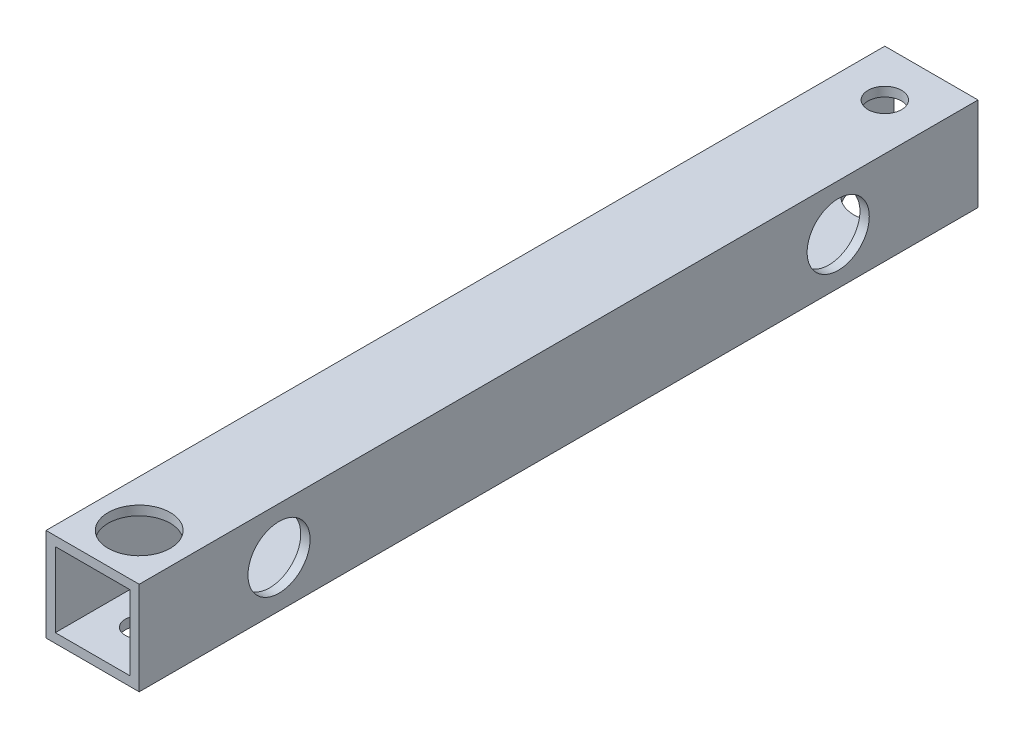
ISO-10303-21;
HEADER;
FILE_DESCRIPTION(('STEP AP214'),'2;1');
FILE_NAME('part.step','',(''),(''),'','','');
FILE_SCHEMA(('AUTOMOTIVE_DESIGN { 1 0 10303 214 1 1 1 1 }'));
ENDSEC;
DATA;
#1=APPLICATION_CONTEXT('core data for automotive mechanical design processes');
#2=APPLICATION_PROTOCOL_DEFINITION('international standard','automotive_design',2000,#1);
#3=PRODUCT_CONTEXT('',#1,'mechanical');
#4=PRODUCT('Part','Part','',(#3));
#5=PRODUCT_RELATED_PRODUCT_CATEGORY('part','',(#4));
#6=PRODUCT_DEFINITION_FORMATION('','',#4);
#7=PRODUCT_DEFINITION_CONTEXT('part definition',#1,'design');
#8=PRODUCT_DEFINITION('design','',#6,#7);
#9=PRODUCT_DEFINITION_SHAPE('','',#8);
#10=(LENGTH_UNIT() NAMED_UNIT(*) SI_UNIT(.MILLI.,.METRE.));
#11=(NAMED_UNIT(*) PLANE_ANGLE_UNIT() SI_UNIT($,.RADIAN.));
#12=(NAMED_UNIT(*) SI_UNIT($,.STERADIAN.) SOLID_ANGLE_UNIT());
#13=UNCERTAINTY_MEASURE_WITH_UNIT(LENGTH_MEASURE(1.E-05),#10,'distance_accuracy_value','');
#14=(GEOMETRIC_REPRESENTATION_CONTEXT(3) GLOBAL_UNCERTAINTY_ASSIGNED_CONTEXT((#13)) GLOBAL_UNIT_ASSIGNED_CONTEXT((#10,
#11,#12)) REPRESENTATION_CONTEXT('',''));
#15=CARTESIAN_POINT('',(0.,0.,0.));
#16=DIRECTION('',(0.,0.,1.));
#17=DIRECTION('',(1.,0.,0.));
#18=AXIS2_PLACEMENT_3D('',#15,#16,#17);
#19=CARTESIAN_POINT('',(0.,0.,135.));
#20=DIRECTION('',(0.,0.,-1.));
#21=DIRECTION('',(-1.,0.,0.));
#22=AXIS2_PLACEMENT_3D('',#19,#20,#21);
#23=PLANE('',#22);
#24=DIRECTION('',(0.,1.,0.));
#25=VECTOR('',#24,1.);
#26=CARTESIAN_POINT('',(7.5,-7.5,135.));
#27=LINE('',#26,#25);
#28=CARTESIAN_POINT('',(7.5,-7.5,135.));
#29=VERTEX_POINT('',#28);
#30=CARTESIAN_POINT('',(7.5,7.5,135.));
#31=VERTEX_POINT('',#30);
#32=EDGE_CURVE('E162',#29,#31,#27,.T.);
#33=ORIENTED_EDGE('',*,*,#32,.T.);
#34=DIRECTION('',(-1.,0.,0.));
#35=VECTOR('',#34,1.);
#36=CARTESIAN_POINT('',(-7.5,7.5,135.));
#37=LINE('',#36,#35);
#38=CARTESIAN_POINT('',(-7.5,7.5,135.));
#39=VERTEX_POINT('',#38);
#40=EDGE_CURVE('E166',#31,#39,#37,.T.);
#41=ORIENTED_EDGE('',*,*,#40,.T.);
#42=DIRECTION('',(0.,-1.,0.));
#43=VECTOR('',#42,1.);
#44=CARTESIAN_POINT('',(-7.5,-7.5,135.));
#45=LINE('',#44,#43);
#46=CARTESIAN_POINT('',(-7.5,-7.5,135.));
#47=VERTEX_POINT('',#46);
#48=EDGE_CURVE('E170',#39,#47,#45,.T.);
#49=ORIENTED_EDGE('',*,*,#48,.T.);
#50=DIRECTION('',(1.,0.,0.));
#51=VECTOR('',#50,1.);
#52=CARTESIAN_POINT('',(-7.5,-7.5,135.));
#53=LINE('',#52,#51);
#54=EDGE_CURVE('E173',#47,#29,#53,.T.);
#55=ORIENTED_EDGE('',*,*,#54,.T.);
#56=EDGE_LOOP('',(#33,#41,#49,#55));
#57=FACE_BOUND('',#56,.T.);
#58=DIRECTION('',(0.,1.,0.));
#59=VECTOR('',#58,1.);
#60=CARTESIAN_POINT('',(6.,-6.,135.));
#61=LINE('',#60,#59);
#62=CARTESIAN_POINT('',(6.,-6.,135.));
#63=VERTEX_POINT('',#62);
#64=CARTESIAN_POINT('',(6.,6.,135.));
#65=VERTEX_POINT('',#64);
#66=EDGE_CURVE('E111',#63,#65,#61,.T.);
#67=ORIENTED_EDGE('',*,*,#66,.F.);
#68=DIRECTION('',(1.,0.,0.));
#69=VECTOR('',#68,1.);
#70=CARTESIAN_POINT('',(-6.,-6.,135.));
#71=LINE('',#70,#69);
#72=CARTESIAN_POINT('',(-6.,-6.,135.));
#73=VERTEX_POINT('',#72);
#74=EDGE_CURVE('E138',#73,#63,#71,.T.);
#75=ORIENTED_EDGE('',*,*,#74,.F.);
#76=DIRECTION('',(0.,-1.,0.));
#77=VECTOR('',#76,1.);
#78=CARTESIAN_POINT('',(-6.,-6.,135.));
#79=LINE('',#78,#77);
#80=CARTESIAN_POINT('',(-6.,6.,135.));
#81=VERTEX_POINT('',#80);
#82=EDGE_CURVE('E133',#81,#73,#79,.T.);
#83=ORIENTED_EDGE('',*,*,#82,.F.);
#84=DIRECTION('',(-1.,0.,0.));
#85=VECTOR('',#84,1.);
#86=CARTESIAN_POINT('',(-6.,6.,135.));
#87=LINE('',#86,#85);
#88=EDGE_CURVE('E120',#65,#81,#87,.T.);
#89=ORIENTED_EDGE('',*,*,#88,.F.);
#90=EDGE_LOOP('',(#67,#75,#83,#89));
#91=FACE_BOUND('',#90,.T.);
#92=ADVANCED_FACE('F43',(#57,#91),#23,.F.);
#93=CARTESIAN_POINT('',(0.,0.,0.));
#94=DIRECTION('',(0.,0.,-1.));
#95=DIRECTION('',(-1.,0.,0.));
#96=AXIS2_PLACEMENT_3D('',#93,#94,#95);
#97=PLANE('',#96);
#98=DIRECTION('',(0.,1.,0.));
#99=VECTOR('',#98,1.);
#100=CARTESIAN_POINT('',(7.5,-7.5,0.));
#101=LINE('',#100,#99);
#102=CARTESIAN_POINT('',(7.5,-7.5,0.));
#103=VERTEX_POINT('',#102);
#104=CARTESIAN_POINT('',(7.5,7.5,0.));
#105=VERTEX_POINT('',#104);
#106=EDGE_CURVE('E129',#103,#105,#101,.T.);
#107=ORIENTED_EDGE('',*,*,#106,.F.);
#108=DIRECTION('',(1.,0.,0.));
#109=VECTOR('',#108,1.);
#110=CARTESIAN_POINT('',(-7.5,-7.5,0.));
#111=LINE('',#110,#109);
#112=CARTESIAN_POINT('',(-7.5,-7.5,0.));
#113=VERTEX_POINT('',#112);
#114=EDGE_CURVE('E167',#113,#103,#111,.T.);
#115=ORIENTED_EDGE('',*,*,#114,.F.);
#116=DIRECTION('',(0.,-1.,0.));
#117=VECTOR('',#116,1.);
#118=CARTESIAN_POINT('',(-7.5,-7.5,0.));
#119=LINE('',#118,#117);
#120=CARTESIAN_POINT('',(-7.5,7.5,0.));
#121=VERTEX_POINT('',#120);
#122=EDGE_CURVE('E183',#121,#113,#119,.T.);
#123=ORIENTED_EDGE('',*,*,#122,.F.);
#124=DIRECTION('',(-1.,0.,0.));
#125=VECTOR('',#124,1.);
#126=CARTESIAN_POINT('',(-7.5,7.5,0.));
#127=LINE('',#126,#125);
#128=EDGE_CURVE('E180',#105,#121,#127,.T.);
#129=ORIENTED_EDGE('',*,*,#128,.F.);
#130=EDGE_LOOP('',(#107,#115,#123,#129));
#131=FACE_BOUND('',#130,.T.);
#132=DIRECTION('',(1.,0.,0.));
#133=VECTOR('',#132,1.);
#134=CARTESIAN_POINT('',(-6.,-6.,0.));
#135=LINE('',#134,#133);
#136=CARTESIAN_POINT('',(-6.,-6.,0.));
#137=VERTEX_POINT('',#136);
#138=CARTESIAN_POINT('',(6.,-6.,0.));
#139=VERTEX_POINT('',#138);
#140=EDGE_CURVE('E121',#137,#139,#135,.T.);
#141=ORIENTED_EDGE('',*,*,#140,.T.);
#142=DIRECTION('',(0.,1.,0.));
#143=VECTOR('',#142,1.);
#144=CARTESIAN_POINT('',(6.,-6.,0.));
#145=LINE('',#144,#143);
#146=CARTESIAN_POINT('',(6.,6.,0.));
#147=VERTEX_POINT('',#146);
#148=EDGE_CURVE('E69',#139,#147,#145,.T.);
#149=ORIENTED_EDGE('',*,*,#148,.T.);
#150=DIRECTION('',(-1.,0.,0.));
#151=VECTOR('',#150,1.);
#152=CARTESIAN_POINT('',(-6.,6.,0.));
#153=LINE('',#152,#151);
#154=CARTESIAN_POINT('',(-6.,6.,0.));
#155=VERTEX_POINT('',#154);
#156=EDGE_CURVE('E127',#147,#155,#153,.T.);
#157=ORIENTED_EDGE('',*,*,#156,.T.);
#158=DIRECTION('',(0.,-1.,0.));
#159=VECTOR('',#158,1.);
#160=CARTESIAN_POINT('',(-6.,-6.,0.));
#161=LINE('',#160,#159);
#162=EDGE_CURVE('E149',#155,#137,#161,.T.);
#163=ORIENTED_EDGE('',*,*,#162,.T.);
#164=EDGE_LOOP('',(#141,#149,#157,#163));
#165=FACE_BOUND('',#164,.T.);
#166=ADVANCED_FACE('F275',(#131,#165),#97,.T.);
#167=CARTESIAN_POINT('',(7.5,-7.5,135.));
#168=DIRECTION('',(-1.,0.,0.));
#169=DIRECTION('',(0.,0.,1.));
#170=AXIS2_PLACEMENT_3D('',#167,#168,#169);
#171=PLANE('',#170);
#172=CARTESIAN_POINT('',(7.5,0.,22.5));
#173=DIRECTION('',(1.,0.,0.));
#174=DIRECTION('',(0.,0.,-1.));
#175=AXIS2_PLACEMENT_3D('',#172,#173,#174);
#176=CIRCLE('',#175,5.);
#177=CARTESIAN_POINT('',(7.5,0.,17.5));
#178=VERTEX_POINT('',#177);
#179=EDGE_CURVE('E223',#178,#178,#176,.T.);
#180=ORIENTED_EDGE('',*,*,#179,.F.);
#181=EDGE_LOOP('',(#180));
#182=FACE_BOUND('',#181,.T.);
#183=CARTESIAN_POINT('',(7.5,0.,112.5));
#184=DIRECTION('',(1.,0.,0.));
#185=DIRECTION('',(0.,0.,-1.));
#186=AXIS2_PLACEMENT_3D('',#183,#184,#185);
#187=CIRCLE('',#186,5.);
#188=CARTESIAN_POINT('',(7.5,0.,107.5));
#189=VERTEX_POINT('',#188);
#190=EDGE_CURVE('E237',#189,#189,#187,.T.);
#191=ORIENTED_EDGE('',*,*,#190,.F.);
#192=EDGE_LOOP('',(#191));
#193=FACE_BOUND('',#192,.T.);
#194=ORIENTED_EDGE('',*,*,#106,.T.);
#195=DIRECTION('',(0.,0.,-1.));
#196=VECTOR('',#195,1.);
#197=CARTESIAN_POINT('',(7.5,7.5,135.));
#198=LINE('',#197,#196);
#199=EDGE_CURVE('E11',#31,#105,#198,.T.);
#200=ORIENTED_EDGE('',*,*,#199,.F.);
#201=ORIENTED_EDGE('',*,*,#32,.F.);
#202=DIRECTION('',(0.,0.,-1.));
#203=VECTOR('',#202,1.);
#204=CARTESIAN_POINT('',(7.5,-7.5,135.));
#205=LINE('',#204,#203);
#206=EDGE_CURVE('E176',#29,#103,#205,.T.);
#207=ORIENTED_EDGE('',*,*,#206,.T.);
#208=EDGE_LOOP('',(#194,#200,#201,#207));
#209=FACE_BOUND('',#208,.T.);
#210=ADVANCED_FACE('F45',(#182,#193,#209),#171,.F.);
#211=CARTESIAN_POINT('',(-7.5,7.5,135.));
#212=DIRECTION('',(0.,-1.,0.));
#213=DIRECTION('',(0.,0.,-1.));
#214=AXIS2_PLACEMENT_3D('',#211,#212,#213);
#215=PLANE('',#214);
#216=CARTESIAN_POINT('',(0.,7.5,127.5));
#217=DIRECTION('',(0.,1.,0.));
#218=DIRECTION('',(0.,0.,1.));
#219=AXIS2_PLACEMENT_3D('',#216,#217,#218);
#220=CIRCLE('',#219,5.);
#221=CARTESIAN_POINT('',(0.,7.5,132.5));
#222=VERTEX_POINT('',#221);
#223=EDGE_CURVE('E218',#222,#222,#220,.T.);
#224=ORIENTED_EDGE('',*,*,#223,.F.);
#225=EDGE_LOOP('',(#224));
#226=FACE_BOUND('',#225,.T.);
#227=CARTESIAN_POINT('',(0.,7.5,7.50000000000001));
#228=DIRECTION('',(0.,1.,0.));
#229=DIRECTION('',(0.,0.,1.));
#230=AXIS2_PLACEMENT_3D('',#227,#228,#229);
#231=CIRCLE('',#230,2.7);
#232=CARTESIAN_POINT('',(0.,7.5,10.2));
#233=VERTEX_POINT('',#232);
#234=EDGE_CURVE('E213',#233,#233,#231,.T.);
#235=ORIENTED_EDGE('',*,*,#234,.F.);
#236=EDGE_LOOP('',(#235));
#237=FACE_BOUND('',#236,.T.);
#238=ORIENTED_EDGE('',*,*,#128,.T.);
#239=DIRECTION('',(0.,0.,-1.));
#240=VECTOR('',#239,1.);
#241=CARTESIAN_POINT('',(-7.5,7.5,135.));
#242=LINE('',#241,#240);
#243=EDGE_CURVE('E53',#39,#121,#242,.T.);
#244=ORIENTED_EDGE('',*,*,#243,.F.);
#245=ORIENTED_EDGE('',*,*,#40,.F.);
#246=ORIENTED_EDGE('',*,*,#199,.T.);
#247=EDGE_LOOP('',(#238,#244,#245,#246));
#248=FACE_BOUND('',#247,.T.);
#249=ADVANCED_FACE('F291',(#226,#237,#248),#215,.F.);
#250=CARTESIAN_POINT('',(-7.5,-7.5,135.));
#251=DIRECTION('',(1.,0.,0.));
#252=DIRECTION('',(0.,0.,-1.));
#253=AXIS2_PLACEMENT_3D('',#250,#251,#252);
#254=PLANE('',#253);
#255=CARTESIAN_POINT('',(-7.5,0.,112.5));
#256=DIRECTION('',(1.,0.,0.));
#257=DIRECTION('',(0.,0.,-1.));
#258=AXIS2_PLACEMENT_3D('',#255,#256,#257);
#259=CIRCLE('',#258,2.7);
#260=CARTESIAN_POINT('',(-7.5,0.,109.8));
#261=VERTEX_POINT('',#260);
#262=EDGE_CURVE('E146',#261,#261,#259,.T.);
#263=ORIENTED_EDGE('',*,*,#262,.T.);
#264=EDGE_LOOP('',(#263));
#265=FACE_BOUND('',#264,.T.);
#266=CARTESIAN_POINT('',(-7.5,0.,22.5));
#267=DIRECTION('',(1.,0.,0.));
#268=DIRECTION('',(0.,0.,-1.));
#269=AXIS2_PLACEMENT_3D('',#266,#267,#268);
#270=CIRCLE('',#269,2.7);
#271=CARTESIAN_POINT('',(-7.5,0.,19.8));
#272=VERTEX_POINT('',#271);
#273=EDGE_CURVE('E202',#272,#272,#270,.T.);
#274=ORIENTED_EDGE('',*,*,#273,.T.);
#275=EDGE_LOOP('',(#274));
#276=FACE_BOUND('',#275,.T.);
#277=ORIENTED_EDGE('',*,*,#122,.T.);
#278=DIRECTION('',(0.,0.,-1.));
#279=VECTOR('',#278,1.);
#280=CARTESIAN_POINT('',(-7.5,-7.5,135.));
#281=LINE('',#280,#279);
#282=EDGE_CURVE('E191',#47,#113,#281,.T.);
#283=ORIENTED_EDGE('',*,*,#282,.F.);
#284=ORIENTED_EDGE('',*,*,#48,.F.);
#285=ORIENTED_EDGE('',*,*,#243,.T.);
#286=EDGE_LOOP('',(#277,#283,#284,#285));
#287=FACE_BOUND('',#286,.T.);
#288=ADVANCED_FACE('F255',(#265,#276,#287),#254,.F.);
#289=CARTESIAN_POINT('',(-7.5,-7.5,135.));
#290=DIRECTION('',(0.,1.,0.));
#291=DIRECTION('',(0.,0.,1.));
#292=AXIS2_PLACEMENT_3D('',#289,#290,#291);
#293=PLANE('',#292);
#294=CARTESIAN_POINT('',(0.,-7.5,7.50000000000001));
#295=DIRECTION('',(0.,-1.,0.));
#296=DIRECTION('',(0.,0.,-1.));
#297=AXIS2_PLACEMENT_3D('',#294,#295,#296);
#298=CIRCLE('',#297,5.);
#299=CARTESIAN_POINT('',(0.,-7.5,2.5));
#300=VERTEX_POINT('',#299);
#301=EDGE_CURVE('E363',#300,#300,#298,.T.);
#302=ORIENTED_EDGE('',*,*,#301,.F.);
#303=EDGE_LOOP('',(#302));
#304=FACE_BOUND('',#303,.T.);
#305=CARTESIAN_POINT('',(0.,-7.5,127.5));
#306=DIRECTION('',(0.,1.,0.));
#307=DIRECTION('',(0.,0.,1.));
#308=AXIS2_PLACEMENT_3D('',#305,#306,#307);
#309=CIRCLE('',#308,2.25);
#310=CARTESIAN_POINT('',(0.,-7.5,129.75));
#311=VERTEX_POINT('',#310);
#312=EDGE_CURVE('E212',#311,#311,#309,.T.);
#313=ORIENTED_EDGE('',*,*,#312,.T.);
#314=EDGE_LOOP('',(#313));
#315=FACE_BOUND('',#314,.T.);
#316=ORIENTED_EDGE('',*,*,#114,.T.);
#317=ORIENTED_EDGE('',*,*,#206,.F.);
#318=ORIENTED_EDGE('',*,*,#54,.F.);
#319=ORIENTED_EDGE('',*,*,#282,.T.);
#320=EDGE_LOOP('',(#316,#317,#318,#319));
#321=FACE_BOUND('',#320,.T.);
#322=ADVANCED_FACE('F286',(#304,#315,#321),#293,.F.);
#323=CARTESIAN_POINT('',(6.,-6.,135.));
#324=DIRECTION('',(-1.,0.,0.));
#325=DIRECTION('',(0.,0.,1.));
#326=AXIS2_PLACEMENT_3D('',#323,#324,#325);
#327=PLANE('',#326);
#328=CARTESIAN_POINT('',(6.,0.,22.5));
#329=DIRECTION('',(-1.,0.,0.));
#330=DIRECTION('',(0.,0.,1.));
#331=AXIS2_PLACEMENT_3D('',#328,#329,#330);
#332=CIRCLE('',#331,5.);
#333=CARTESIAN_POINT('',(6.,0.,27.5));
#334=VERTEX_POINT('',#333);
#335=EDGE_CURVE('E222',#334,#334,#332,.T.);
#336=ORIENTED_EDGE('',*,*,#335,.F.);
#337=EDGE_LOOP('',(#336));
#338=FACE_BOUND('',#337,.T.);
#339=CARTESIAN_POINT('',(6.,0.,112.5));
#340=DIRECTION('',(-1.,0.,0.));
#341=DIRECTION('',(0.,0.,1.));
#342=AXIS2_PLACEMENT_3D('',#339,#340,#341);
#343=CIRCLE('',#342,5.);
#344=CARTESIAN_POINT('',(6.,0.,117.5));
#345=VERTEX_POINT('',#344);
#346=EDGE_CURVE('E219',#345,#345,#343,.T.);
#347=ORIENTED_EDGE('',*,*,#346,.F.);
#348=EDGE_LOOP('',(#347));
#349=FACE_BOUND('',#348,.T.);
#350=ORIENTED_EDGE('',*,*,#148,.F.);
#351=DIRECTION('',(0.,0.,-1.));
#352=VECTOR('',#351,1.);
#353=CARTESIAN_POINT('',(6.,-6.,135.));
#354=LINE('',#353,#352);
#355=EDGE_CURVE('E115',#63,#139,#354,.T.);
#356=ORIENTED_EDGE('',*,*,#355,.F.);
#357=ORIENTED_EDGE('',*,*,#66,.T.);
#358=DIRECTION('',(0.,0.,-1.));
#359=VECTOR('',#358,1.);
#360=CARTESIAN_POINT('',(6.,6.,135.));
#361=LINE('',#360,#359);
#362=EDGE_CURVE('E114',#65,#147,#361,.T.);
#363=ORIENTED_EDGE('',*,*,#362,.T.);
#364=EDGE_LOOP('',(#350,#356,#357,#363));
#365=FACE_BOUND('',#364,.T.);
#366=ADVANCED_FACE('F113',(#338,#349,#365),#327,.T.);
#367=CARTESIAN_POINT('',(-6.,6.,135.));
#368=DIRECTION('',(0.,-1.,0.));
#369=DIRECTION('',(0.,0.,-1.));
#370=AXIS2_PLACEMENT_3D('',#367,#368,#369);
#371=PLANE('',#370);
#372=CARTESIAN_POINT('',(0.,6.,127.5));
#373=DIRECTION('',(0.,-1.,0.));
#374=DIRECTION('',(0.,0.,-1.));
#375=AXIS2_PLACEMENT_3D('',#372,#373,#374);
#376=CIRCLE('',#375,5.);
#377=CARTESIAN_POINT('',(0.,6.,122.5));
#378=VERTEX_POINT('',#377);
#379=EDGE_CURVE('E214',#378,#378,#376,.T.);
#380=ORIENTED_EDGE('',*,*,#379,.F.);
#381=EDGE_LOOP('',(#380));
#382=FACE_BOUND('',#381,.T.);
#383=CARTESIAN_POINT('',(0.,6.,7.50000000000001));
#384=DIRECTION('',(0.,-1.,0.));
#385=DIRECTION('',(0.,0.,-1.));
#386=AXIS2_PLACEMENT_3D('',#383,#384,#385);
#387=CIRCLE('',#386,2.7);
#388=CARTESIAN_POINT('',(0.,6.,4.80000000000001));
#389=VERTEX_POINT('',#388);
#390=EDGE_CURVE('E203',#389,#389,#387,.T.);
#391=ORIENTED_EDGE('',*,*,#390,.F.);
#392=EDGE_LOOP('',(#391));
#393=FACE_BOUND('',#392,.T.);
#394=ORIENTED_EDGE('',*,*,#156,.F.);
#395=ORIENTED_EDGE('',*,*,#362,.F.);
#396=ORIENTED_EDGE('',*,*,#88,.T.);
#397=DIRECTION('',(0.,0.,-1.));
#398=VECTOR('',#397,1.);
#399=CARTESIAN_POINT('',(-6.,6.,135.));
#400=LINE('',#399,#398);
#401=EDGE_CURVE('E130',#81,#155,#400,.T.);
#402=ORIENTED_EDGE('',*,*,#401,.T.);
#403=EDGE_LOOP('',(#394,#395,#396,#402));
#404=FACE_BOUND('',#403,.T.);
#405=ADVANCED_FACE('F124',(#382,#393,#404),#371,.T.);
#406=CARTESIAN_POINT('',(-6.,-6.,135.));
#407=DIRECTION('',(1.,0.,0.));
#408=DIRECTION('',(0.,0.,-1.));
#409=AXIS2_PLACEMENT_3D('',#406,#407,#408);
#410=PLANE('',#409);
#411=CARTESIAN_POINT('',(-6.,0.,112.5));
#412=DIRECTION('',(1.,0.,0.));
#413=DIRECTION('',(0.,0.,-1.));
#414=AXIS2_PLACEMENT_3D('',#411,#412,#413);
#415=CIRCLE('',#414,2.7);
#416=CARTESIAN_POINT('',(-6.,0.,109.8));
#417=VERTEX_POINT('',#416);
#418=EDGE_CURVE('E204',#417,#417,#415,.T.);
#419=ORIENTED_EDGE('',*,*,#418,.F.);
#420=EDGE_LOOP('',(#419));
#421=FACE_BOUND('',#420,.T.);
#422=CARTESIAN_POINT('',(-6.,0.,22.5));
#423=DIRECTION('',(1.,0.,0.));
#424=DIRECTION('',(0.,0.,-1.));
#425=AXIS2_PLACEMENT_3D('',#422,#423,#424);
#426=CIRCLE('',#425,2.7);
#427=CARTESIAN_POINT('',(-6.,0.,19.8));
#428=VERTEX_POINT('',#427);
#429=EDGE_CURVE('E198',#428,#428,#426,.T.);
#430=ORIENTED_EDGE('',*,*,#429,.F.);
#431=EDGE_LOOP('',(#430));
#432=FACE_BOUND('',#431,.T.);
#433=ORIENTED_EDGE('',*,*,#162,.F.);
#434=ORIENTED_EDGE('',*,*,#401,.F.);
#435=ORIENTED_EDGE('',*,*,#82,.T.);
#436=DIRECTION('',(0.,0.,-1.));
#437=VECTOR('',#436,1.);
#438=CARTESIAN_POINT('',(-6.,-6.,135.));
#439=LINE('',#438,#437);
#440=EDGE_CURVE('E61',#73,#137,#439,.T.);
#441=ORIENTED_EDGE('',*,*,#440,.T.);
#442=EDGE_LOOP('',(#433,#434,#435,#441));
#443=FACE_BOUND('',#442,.T.);
#444=ADVANCED_FACE('F319',(#421,#432,#443),#410,.T.);
#445=CARTESIAN_POINT('',(-6.,-6.,135.));
#446=DIRECTION('',(0.,1.,0.));
#447=DIRECTION('',(0.,0.,1.));
#448=AXIS2_PLACEMENT_3D('',#445,#446,#447);
#449=PLANE('',#448);
#450=CARTESIAN_POINT('',(0.,-6.,7.50000000000001));
#451=DIRECTION('',(0.,1.,0.));
#452=DIRECTION('',(0.,0.,1.));
#453=AXIS2_PLACEMENT_3D('',#450,#451,#452);
#454=CIRCLE('',#453,5.);
#455=CARTESIAN_POINT('',(0.,-6.,12.5));
#456=VERTEX_POINT('',#455);
#457=EDGE_CURVE('E47',#456,#456,#454,.T.);
#458=ORIENTED_EDGE('',*,*,#457,.F.);
#459=EDGE_LOOP('',(#458));
#460=FACE_BOUND('',#459,.T.);
#461=CARTESIAN_POINT('',(0.,-6.,127.5));
#462=DIRECTION('',(0.,1.,0.));
#463=DIRECTION('',(0.,0.,1.));
#464=AXIS2_PLACEMENT_3D('',#461,#462,#463);
#465=CIRCLE('',#464,2.25);
#466=CARTESIAN_POINT('',(0.,-6.,129.75));
#467=VERTEX_POINT('',#466);
#468=EDGE_CURVE('E208',#467,#467,#465,.T.);
#469=ORIENTED_EDGE('',*,*,#468,.F.);
#470=EDGE_LOOP('',(#469));
#471=FACE_BOUND('',#470,.T.);
#472=ORIENTED_EDGE('',*,*,#140,.F.);
#473=ORIENTED_EDGE('',*,*,#440,.F.);
#474=ORIENTED_EDGE('',*,*,#74,.T.);
#475=ORIENTED_EDGE('',*,*,#355,.T.);
#476=EDGE_LOOP('',(#472,#473,#474,#475));
#477=FACE_BOUND('',#476,.T.);
#478=ADVANCED_FACE('F271',(#460,#471,#477),#449,.T.);
#479=CARTESIAN_POINT('',(-17.5,0.,22.5));
#480=DIRECTION('',(1.,0.,0.));
#481=DIRECTION('',(0.,0.,-1.));
#482=AXIS2_PLACEMENT_3D('',#479,#480,#481);
#483=CYLINDRICAL_SURFACE('',#482,2.7);
#484=ORIENTED_EDGE('',*,*,#429,.T.);
#485=EDGE_LOOP('',(#484));
#486=FACE_BOUND('',#485,.T.);
#487=ORIENTED_EDGE('',*,*,#273,.F.);
#488=EDGE_LOOP('',(#487));
#489=FACE_BOUND('',#488,.T.);
#490=ADVANCED_FACE('F261',(#486,#489),#483,.F.);
#491=CARTESIAN_POINT('',(-17.5,0.,112.5));
#492=DIRECTION('',(1.,0.,0.));
#493=DIRECTION('',(0.,0.,-1.));
#494=AXIS2_PLACEMENT_3D('',#491,#492,#493);
#495=CYLINDRICAL_SURFACE('',#494,2.7);
#496=ORIENTED_EDGE('',*,*,#418,.T.);
#497=EDGE_LOOP('',(#496));
#498=FACE_BOUND('',#497,.T.);
#499=ORIENTED_EDGE('',*,*,#262,.F.);
#500=EDGE_LOOP('',(#499));
#501=FACE_BOUND('',#500,.T.);
#502=ADVANCED_FACE('F258',(#498,#501),#495,.F.);
#503=CARTESIAN_POINT('',(0.,-17.5,127.5));
#504=DIRECTION('',(0.,1.,0.));
#505=DIRECTION('',(0.,0.,1.));
#506=AXIS2_PLACEMENT_3D('',#503,#504,#505);
#507=CYLINDRICAL_SURFACE('',#506,2.25);
#508=ORIENTED_EDGE('',*,*,#468,.T.);
#509=EDGE_LOOP('',(#508));
#510=FACE_BOUND('',#509,.T.);
#511=ORIENTED_EDGE('',*,*,#312,.F.);
#512=EDGE_LOOP('',(#511));
#513=FACE_BOUND('',#512,.T.);
#514=ADVANCED_FACE('F260',(#510,#513),#507,.F.);
#515=CARTESIAN_POINT('',(0.,-17.5,7.50000000000001));
#516=DIRECTION('',(0.,1.,0.));
#517=DIRECTION('',(0.,0.,1.));
#518=AXIS2_PLACEMENT_3D('',#515,#516,#517);
#519=CYLINDRICAL_SURFACE('',#518,2.7);
#520=ORIENTED_EDGE('',*,*,#390,.T.);
#521=EDGE_LOOP('',(#520));
#522=FACE_BOUND('',#521,.T.);
#523=ORIENTED_EDGE('',*,*,#234,.T.);
#524=EDGE_LOOP('',(#523));
#525=FACE_BOUND('',#524,.T.);
#526=ADVANCED_FACE('F268',(#522,#525),#519,.F.);
#527=CARTESIAN_POINT('',(0.,-2.5,127.5));
#528=DIRECTION('',(0.,1.,0.));
#529=DIRECTION('',(0.,0.,1.));
#530=AXIS2_PLACEMENT_3D('',#527,#528,#529);
#531=CYLINDRICAL_SURFACE('',#530,5.);
#532=ORIENTED_EDGE('',*,*,#379,.T.);
#533=EDGE_LOOP('',(#532));
#534=FACE_BOUND('',#533,.T.);
#535=ORIENTED_EDGE('',*,*,#223,.T.);
#536=EDGE_LOOP('',(#535));
#537=FACE_BOUND('',#536,.T.);
#538=ADVANCED_FACE('F341',(#534,#537),#531,.F.);
#539=CARTESIAN_POINT('',(-2.5,0.,112.5));
#540=DIRECTION('',(1.,0.,0.));
#541=DIRECTION('',(0.,0.,-1.));
#542=AXIS2_PLACEMENT_3D('',#539,#540,#541);
#543=CYLINDRICAL_SURFACE('',#542,5.);
#544=ORIENTED_EDGE('',*,*,#346,.T.);
#545=EDGE_LOOP('',(#544));
#546=FACE_BOUND('',#545,.T.);
#547=ORIENTED_EDGE('',*,*,#190,.T.);
#548=EDGE_LOOP('',(#547));
#549=FACE_BOUND('',#548,.T.);
#550=ADVANCED_FACE('F345',(#546,#549),#543,.F.);
#551=CARTESIAN_POINT('',(-2.5,0.,22.5));
#552=DIRECTION('',(1.,0.,0.));
#553=DIRECTION('',(0.,0.,-1.));
#554=AXIS2_PLACEMENT_3D('',#551,#552,#553);
#555=CYLINDRICAL_SURFACE('',#554,5.);
#556=ORIENTED_EDGE('',*,*,#335,.T.);
#557=EDGE_LOOP('',(#556));
#558=FACE_BOUND('',#557,.T.);
#559=ORIENTED_EDGE('',*,*,#179,.T.);
#560=EDGE_LOOP('',(#559));
#561=FACE_BOUND('',#560,.T.);
#562=ADVANCED_FACE('F351',(#558,#561),#555,.F.);
#563=CARTESIAN_POINT('',(0.,2.5,7.50000000000001));
#564=DIRECTION('',(0.,-1.,0.));
#565=DIRECTION('',(0.,0.,-1.));
#566=AXIS2_PLACEMENT_3D('',#563,#564,#565);
#567=CYLINDRICAL_SURFACE('',#566,5.);
#568=ORIENTED_EDGE('',*,*,#457,.T.);
#569=EDGE_LOOP('',(#568));
#570=FACE_BOUND('',#569,.T.);
#571=ORIENTED_EDGE('',*,*,#301,.T.);
#572=EDGE_LOOP('',(#571));
#573=FACE_BOUND('',#572,.T.);
#574=ADVANCED_FACE('F355',(#570,#573),#567,.F.);
#575=CLOSED_SHELL('',(#92,#166,#210,#249,#288,#322,#366,#405,#444,#478,#490,#502,#514,#526,#538,
#550,#562,#574));
#576=MANIFOLD_SOLID_BREP('B2',#575);
#577=ADVANCED_BREP_SHAPE_REPRESENTATION('',(#18,#576),#14);
#578=SHAPE_DEFINITION_REPRESENTATION(#9,#577);
ENDSEC;
END-ISO-10303-21;
